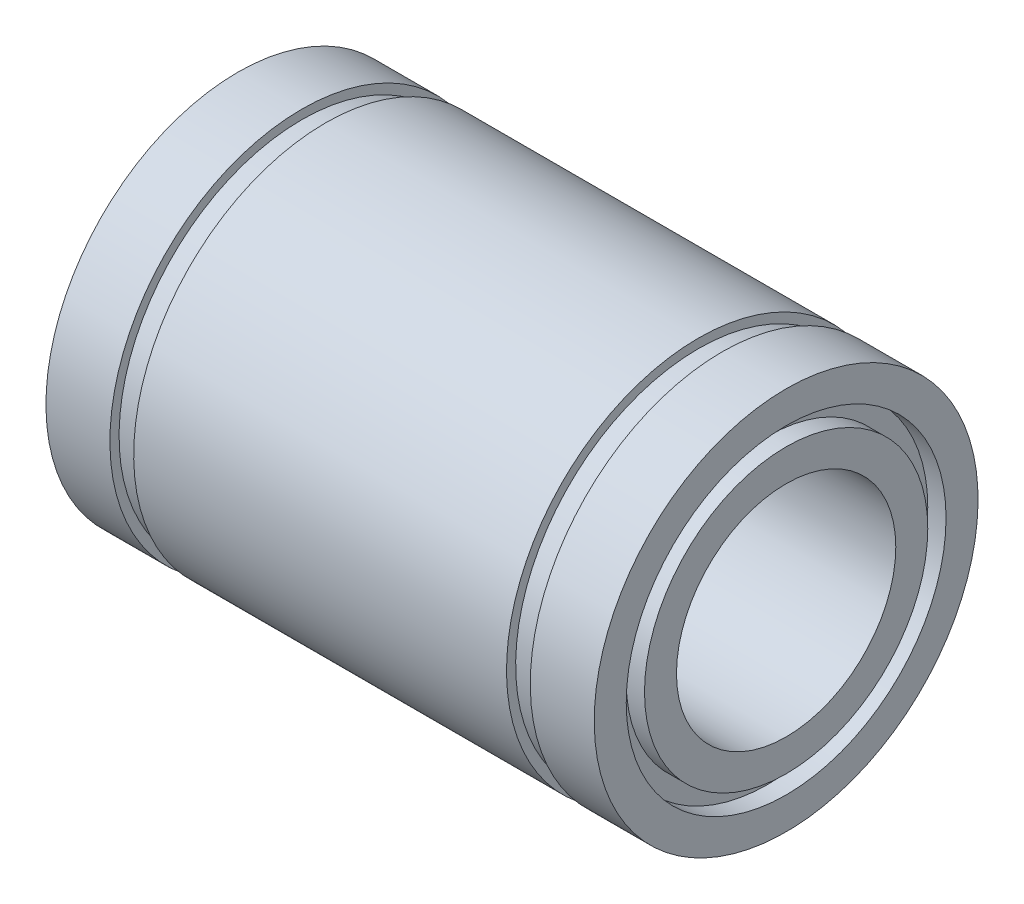
ISO-10303-21;
HEADER;
FILE_DESCRIPTION(('STEP AP214'),'2;1');
FILE_NAME('part.step','',(''),(''),'','','');
FILE_SCHEMA(('AUTOMOTIVE_DESIGN { 1 0 10303 214 1 1 1 1 }'));
ENDSEC;
DATA;
#1=APPLICATION_CONTEXT('core data for automotive mechanical design processes');
#2=APPLICATION_PROTOCOL_DEFINITION('international standard','automotive_design',2000,#1);
#3=PRODUCT_CONTEXT('',#1,'mechanical');
#4=PRODUCT('Part','Part','',(#3));
#5=PRODUCT_RELATED_PRODUCT_CATEGORY('part','',(#4));
#6=PRODUCT_DEFINITION_FORMATION('','',#4);
#7=PRODUCT_DEFINITION_CONTEXT('part definition',#1,'design');
#8=PRODUCT_DEFINITION('design','',#6,#7);
#9=PRODUCT_DEFINITION_SHAPE('','',#8);
#10=(LENGTH_UNIT() NAMED_UNIT(*) SI_UNIT(.MILLI.,.METRE.));
#11=(NAMED_UNIT(*) PLANE_ANGLE_UNIT() SI_UNIT($,.RADIAN.));
#12=(NAMED_UNIT(*) SI_UNIT($,.STERADIAN.) SOLID_ANGLE_UNIT());
#13=UNCERTAINTY_MEASURE_WITH_UNIT(LENGTH_MEASURE(1.E-05),#10,'distance_accuracy_value','');
#14=(GEOMETRIC_REPRESENTATION_CONTEXT(3) GLOBAL_UNCERTAINTY_ASSIGNED_CONTEXT((#13)) GLOBAL_UNIT_ASSIGNED_CONTEXT((#10,
#11,#12)) REPRESENTATION_CONTEXT('',''));
#15=CARTESIAN_POINT('',(0.,0.,0.));
#16=DIRECTION('',(0.,0.,1.));
#17=DIRECTION('',(1.,0.,0.));
#18=AXIS2_PLACEMENT_3D('',#15,#16,#17);
#19=CARTESIAN_POINT('',(-15.,8.75,0.));
#20=DIRECTION('',(-1.,0.,0.));
#21=DIRECTION('',(0.,-1.,0.));
#22=AXIS2_PLACEMENT_3D('',#19,#20,#21);
#23=PLANE('',#22);
#24=CARTESIAN_POINT('',(-15.,0.,0.));
#25=DIRECTION('',(1.,0.,0.));
#26=DIRECTION('',(0.,1.,0.));
#27=AXIS2_PLACEMENT_3D('',#24,#25,#26);
#28=CIRCLE('',#27,8.75);
#29=CARTESIAN_POINT('',(-15.,8.75,0.));
#30=VERTEX_POINT('',#29);
#31=EDGE_CURVE('E121',#30,#30,#28,.T.);
#32=ORIENTED_EDGE('',*,*,#31,.T.);
#33=EDGE_LOOP('',(#32));
#34=FACE_BOUND('',#33,.T.);
#35=CARTESIAN_POINT('',(-15.,0.,0.));
#36=DIRECTION('',(1.,0.,0.));
#37=DIRECTION('',(0.,1.,0.));
#38=AXIS2_PLACEMENT_3D('',#35,#36,#37);
#39=CIRCLE('',#38,10.5);
#40=CARTESIAN_POINT('',(-15.,10.5,0.));
#41=VERTEX_POINT('',#40);
#42=EDGE_CURVE('E10',#41,#41,#39,.T.);
#43=ORIENTED_EDGE('',*,*,#42,.F.);
#44=EDGE_LOOP('',(#43));
#45=FACE_BOUND('',#44,.T.);
#46=ADVANCED_FACE('F38',(#34,#45),#23,.T.);
#47=CARTESIAN_POINT('',(0.,0.,0.));
#48=DIRECTION('',(1.,0.,0.));
#49=DIRECTION('',(0.,1.,0.));
#50=AXIS2_PLACEMENT_3D('',#47,#48,#49);
#51=CYLINDRICAL_SURFACE('',#50,10.5);
#52=ORIENTED_EDGE('',*,*,#42,.T.);
#53=EDGE_LOOP('',(#52));
#54=FACE_BOUND('',#53,.T.);
#55=CARTESIAN_POINT('',(-11.5,0.,0.));
#56=DIRECTION('',(1.,0.,0.));
#57=DIRECTION('',(0.,1.,0.));
#58=AXIS2_PLACEMENT_3D('',#55,#56,#57);
#59=CIRCLE('',#58,10.5);
#60=CARTESIAN_POINT('',(-11.5,10.5,0.));
#61=VERTEX_POINT('',#60);
#62=EDGE_CURVE('E45',#61,#61,#59,.T.);
#63=ORIENTED_EDGE('',*,*,#62,.F.);
#64=EDGE_LOOP('',(#63));
#65=FACE_BOUND('',#64,.T.);
#66=ADVANCED_FACE('F140',(#54,#65),#51,.T.);
#67=CARTESIAN_POINT('',(-11.5,10.5,0.));
#68=DIRECTION('',(1.,0.,0.));
#69=DIRECTION('',(0.,1.,0.));
#70=AXIS2_PLACEMENT_3D('',#67,#68,#69);
#71=PLANE('',#70);
#72=ORIENTED_EDGE('',*,*,#62,.T.);
#73=EDGE_LOOP('',(#72));
#74=FACE_BOUND('',#73,.T.);
#75=CARTESIAN_POINT('',(-11.5,0.,0.));
#76=DIRECTION('',(1.,0.,0.));
#77=DIRECTION('',(0.,1.,0.));
#78=AXIS2_PLACEMENT_3D('',#75,#76,#77);
#79=CIRCLE('',#78,10.);
#80=CARTESIAN_POINT('',(-11.5,10.,0.));
#81=VERTEX_POINT('',#80);
#82=EDGE_CURVE('E52',#81,#81,#79,.T.);
#83=ORIENTED_EDGE('',*,*,#82,.F.);
#84=EDGE_LOOP('',(#83));
#85=FACE_BOUND('',#84,.T.);
#86=ADVANCED_FACE('F144',(#74,#85),#71,.T.);
#87=CARTESIAN_POINT('',(0.,0.,0.));
#88=DIRECTION('',(1.,0.,0.));
#89=DIRECTION('',(0.,1.,0.));
#90=AXIS2_PLACEMENT_3D('',#87,#88,#89);
#91=CYLINDRICAL_SURFACE('',#90,10.);
#92=ORIENTED_EDGE('',*,*,#82,.T.);
#93=EDGE_LOOP('',(#92));
#94=FACE_BOUND('',#93,.T.);
#95=CARTESIAN_POINT('',(-10.2,0.,0.));
#96=DIRECTION('',(1.,0.,0.));
#97=DIRECTION('',(0.,1.,0.));
#98=AXIS2_PLACEMENT_3D('',#95,#96,#97);
#99=CIRCLE('',#98,10.);
#100=CARTESIAN_POINT('',(-10.2,10.,0.));
#101=VERTEX_POINT('',#100);
#102=EDGE_CURVE('E59',#101,#101,#99,.T.);
#103=ORIENTED_EDGE('',*,*,#102,.F.);
#104=EDGE_LOOP('',(#103));
#105=FACE_BOUND('',#104,.T.);
#106=ADVANCED_FACE('F148',(#94,#105),#91,.T.);
#107=CARTESIAN_POINT('',(-10.2,10.,0.));
#108=DIRECTION('',(-1.,0.,0.));
#109=DIRECTION('',(0.,-1.,0.));
#110=AXIS2_PLACEMENT_3D('',#107,#108,#109);
#111=PLANE('',#110);
#112=ORIENTED_EDGE('',*,*,#102,.T.);
#113=EDGE_LOOP('',(#112));
#114=FACE_BOUND('',#113,.T.);
#115=CARTESIAN_POINT('',(-10.2,0.,0.));
#116=DIRECTION('',(1.,0.,0.));
#117=DIRECTION('',(0.,1.,0.));
#118=AXIS2_PLACEMENT_3D('',#115,#116,#117);
#119=CIRCLE('',#118,10.5);
#120=CARTESIAN_POINT('',(-10.2,10.5,0.));
#121=VERTEX_POINT('',#120);
#122=EDGE_CURVE('E65',#121,#121,#119,.T.);
#123=ORIENTED_EDGE('',*,*,#122,.F.);
#124=EDGE_LOOP('',(#123));
#125=FACE_BOUND('',#124,.T.);
#126=ADVANCED_FACE('F154',(#114,#125),#111,.T.);
#127=CARTESIAN_POINT('',(0.,0.,0.));
#128=DIRECTION('',(1.,0.,0.));
#129=DIRECTION('',(0.,1.,0.));
#130=AXIS2_PLACEMENT_3D('',#127,#128,#129);
#131=CYLINDRICAL_SURFACE('',#130,10.5);
#132=ORIENTED_EDGE('',*,*,#122,.T.);
#133=EDGE_LOOP('',(#132));
#134=FACE_BOUND('',#133,.T.);
#135=CARTESIAN_POINT('',(10.2,0.,0.));
#136=DIRECTION('',(1.,0.,0.));
#137=DIRECTION('',(0.,1.,0.));
#138=AXIS2_PLACEMENT_3D('',#135,#136,#137);
#139=CIRCLE('',#138,10.5);
#140=CARTESIAN_POINT('',(10.2,10.5,0.));
#141=VERTEX_POINT('',#140);
#142=EDGE_CURVE('E69',#141,#141,#139,.T.);
#143=ORIENTED_EDGE('',*,*,#142,.F.);
#144=EDGE_LOOP('',(#143));
#145=FACE_BOUND('',#144,.T.);
#146=ADVANCED_FACE('F158',(#134,#145),#131,.T.);
#147=CARTESIAN_POINT('',(10.2,10.5,0.));
#148=DIRECTION('',(1.,0.,0.));
#149=DIRECTION('',(0.,1.,0.));
#150=AXIS2_PLACEMENT_3D('',#147,#148,#149);
#151=PLANE('',#150);
#152=ORIENTED_EDGE('',*,*,#142,.T.);
#153=EDGE_LOOP('',(#152));
#154=FACE_BOUND('',#153,.T.);
#155=CARTESIAN_POINT('',(10.2,0.,0.));
#156=DIRECTION('',(1.,0.,0.));
#157=DIRECTION('',(0.,1.,0.));
#158=AXIS2_PLACEMENT_3D('',#155,#156,#157);
#159=CIRCLE('',#158,10.);
#160=CARTESIAN_POINT('',(10.2,10.,0.));
#161=VERTEX_POINT('',#160);
#162=EDGE_CURVE('E73',#161,#161,#159,.T.);
#163=ORIENTED_EDGE('',*,*,#162,.F.);
#164=EDGE_LOOP('',(#163));
#165=FACE_BOUND('',#164,.T.);
#166=ADVANCED_FACE('F162',(#154,#165),#151,.T.);
#167=CARTESIAN_POINT('',(0.,0.,0.));
#168=DIRECTION('',(1.,0.,0.));
#169=DIRECTION('',(0.,1.,0.));
#170=AXIS2_PLACEMENT_3D('',#167,#168,#169);
#171=CYLINDRICAL_SURFACE('',#170,10.);
#172=ORIENTED_EDGE('',*,*,#162,.T.);
#173=EDGE_LOOP('',(#172));
#174=FACE_BOUND('',#173,.T.);
#175=CARTESIAN_POINT('',(11.5,0.,0.));
#176=DIRECTION('',(1.,0.,0.));
#177=DIRECTION('',(0.,1.,0.));
#178=AXIS2_PLACEMENT_3D('',#175,#176,#177);
#179=CIRCLE('',#178,10.);
#180=CARTESIAN_POINT('',(11.5,10.,0.));
#181=VERTEX_POINT('',#180);
#182=EDGE_CURVE('E76',#181,#181,#179,.T.);
#183=ORIENTED_EDGE('',*,*,#182,.F.);
#184=EDGE_LOOP('',(#183));
#185=FACE_BOUND('',#184,.T.);
#186=ADVANCED_FACE('F166',(#174,#185),#171,.T.);
#187=CARTESIAN_POINT('',(11.5,10.,0.));
#188=DIRECTION('',(-1.,0.,0.));
#189=DIRECTION('',(0.,-1.,0.));
#190=AXIS2_PLACEMENT_3D('',#187,#188,#189);
#191=PLANE('',#190);
#192=ORIENTED_EDGE('',*,*,#182,.T.);
#193=EDGE_LOOP('',(#192));
#194=FACE_BOUND('',#193,.T.);
#195=CARTESIAN_POINT('',(11.5,0.,0.));
#196=DIRECTION('',(1.,0.,0.));
#197=DIRECTION('',(0.,1.,0.));
#198=AXIS2_PLACEMENT_3D('',#195,#196,#197);
#199=CIRCLE('',#198,10.5);
#200=CARTESIAN_POINT('',(11.5,10.5,0.));
#201=VERTEX_POINT('',#200);
#202=EDGE_CURVE('E80',#201,#201,#199,.T.);
#203=ORIENTED_EDGE('',*,*,#202,.F.);
#204=EDGE_LOOP('',(#203));
#205=FACE_BOUND('',#204,.T.);
#206=ADVANCED_FACE('F170',(#194,#205),#191,.T.);
#207=CARTESIAN_POINT('',(0.,0.,0.));
#208=DIRECTION('',(1.,0.,0.));
#209=DIRECTION('',(0.,1.,0.));
#210=AXIS2_PLACEMENT_3D('',#207,#208,#209);
#211=CYLINDRICAL_SURFACE('',#210,10.5);
#212=ORIENTED_EDGE('',*,*,#202,.T.);
#213=EDGE_LOOP('',(#212));
#214=FACE_BOUND('',#213,.T.);
#215=CARTESIAN_POINT('',(15.,0.,0.));
#216=DIRECTION('',(1.,0.,0.));
#217=DIRECTION('',(0.,1.,0.));
#218=AXIS2_PLACEMENT_3D('',#215,#216,#217);
#219=CIRCLE('',#218,10.5);
#220=CARTESIAN_POINT('',(15.,10.5,0.));
#221=VERTEX_POINT('',#220);
#222=EDGE_CURVE('E84',#221,#221,#219,.T.);
#223=ORIENTED_EDGE('',*,*,#222,.F.);
#224=EDGE_LOOP('',(#223));
#225=FACE_BOUND('',#224,.T.);
#226=ADVANCED_FACE('F174',(#214,#225),#211,.T.);
#227=CARTESIAN_POINT('',(15.,10.5,0.));
#228=DIRECTION('',(1.,0.,0.));
#229=DIRECTION('',(0.,1.,0.));
#230=AXIS2_PLACEMENT_3D('',#227,#228,#229);
#231=PLANE('',#230);
#232=ORIENTED_EDGE('',*,*,#222,.T.);
#233=EDGE_LOOP('',(#232));
#234=FACE_BOUND('',#233,.T.);
#235=CARTESIAN_POINT('',(15.,0.,0.));
#236=DIRECTION('',(1.,0.,0.));
#237=DIRECTION('',(0.,1.,0.));
#238=AXIS2_PLACEMENT_3D('',#235,#236,#237);
#239=CIRCLE('',#238,8.74999999999999);
#240=CARTESIAN_POINT('',(15.,8.74999999999999,0.));
#241=VERTEX_POINT('',#240);
#242=EDGE_CURVE('E88',#241,#241,#239,.T.);
#243=ORIENTED_EDGE('',*,*,#242,.F.);
#244=EDGE_LOOP('',(#243));
#245=FACE_BOUND('',#244,.T.);
#246=ADVANCED_FACE('F178',(#234,#245),#231,.T.);
#247=CARTESIAN_POINT('',(0.,0.,0.));
#248=DIRECTION('',(1.,0.,0.));
#249=DIRECTION('',(0.,1.,0.));
#250=AXIS2_PLACEMENT_3D('',#247,#248,#249);
#251=CYLINDRICAL_SURFACE('',#250,8.74999999999999);
#252=ORIENTED_EDGE('',*,*,#242,.T.);
#253=EDGE_LOOP('',(#252));
#254=FACE_BOUND('',#253,.T.);
#255=CARTESIAN_POINT('',(14.,0.,0.));
#256=DIRECTION('',(1.,0.,0.));
#257=DIRECTION('',(0.,1.,0.));
#258=AXIS2_PLACEMENT_3D('',#255,#256,#257);
#259=CIRCLE('',#258,8.74999999999999);
#260=CARTESIAN_POINT('',(14.,8.74999999999999,0.));
#261=VERTEX_POINT('',#260);
#262=EDGE_CURVE('E92',#261,#261,#259,.T.);
#263=ORIENTED_EDGE('',*,*,#262,.F.);
#264=EDGE_LOOP('',(#263));
#265=FACE_BOUND('',#264,.T.);
#266=ADVANCED_FACE('F182',(#254,#265),#251,.F.);
#267=CARTESIAN_POINT('',(14.,8.74999999999999,0.));
#268=DIRECTION('',(1.,0.,0.));
#269=DIRECTION('',(0.,1.,0.));
#270=AXIS2_PLACEMENT_3D('',#267,#268,#269);
#271=PLANE('',#270);
#272=ORIENTED_EDGE('',*,*,#262,.T.);
#273=EDGE_LOOP('',(#272));
#274=FACE_BOUND('',#273,.T.);
#275=CARTESIAN_POINT('',(14.,0.,0.));
#276=DIRECTION('',(1.,0.,0.));
#277=DIRECTION('',(0.,1.,0.));
#278=AXIS2_PLACEMENT_3D('',#275,#276,#277);
#279=CIRCLE('',#278,7.74999999999999);
#280=CARTESIAN_POINT('',(14.,7.74999999999999,0.));
#281=VERTEX_POINT('',#280);
#282=EDGE_CURVE('E96',#281,#281,#279,.T.);
#283=ORIENTED_EDGE('',*,*,#282,.F.);
#284=EDGE_LOOP('',(#283));
#285=FACE_BOUND('',#284,.T.);
#286=ADVANCED_FACE('F186',(#274,#285),#271,.T.);
#287=CARTESIAN_POINT('',(0.,0.,0.));
#288=DIRECTION('',(1.,0.,0.));
#289=DIRECTION('',(0.,1.,0.));
#290=AXIS2_PLACEMENT_3D('',#287,#288,#289);
#291=CYLINDRICAL_SURFACE('',#290,7.74999999999999);
#292=ORIENTED_EDGE('',*,*,#282,.T.);
#293=EDGE_LOOP('',(#292));
#294=FACE_BOUND('',#293,.T.);
#295=CARTESIAN_POINT('',(15.,0.,0.));
#296=DIRECTION('',(1.,0.,0.));
#297=DIRECTION('',(0.,1.,0.));
#298=AXIS2_PLACEMENT_3D('',#295,#296,#297);
#299=CIRCLE('',#298,7.74999999999999);
#300=CARTESIAN_POINT('',(15.,7.74999999999999,0.));
#301=VERTEX_POINT('',#300);
#302=EDGE_CURVE('E100',#301,#301,#299,.T.);
#303=ORIENTED_EDGE('',*,*,#302,.F.);
#304=EDGE_LOOP('',(#303));
#305=FACE_BOUND('',#304,.T.);
#306=ADVANCED_FACE('F190',(#294,#305),#291,.T.);
#307=CARTESIAN_POINT('',(15.,7.74999999999999,0.));
#308=DIRECTION('',(1.,0.,0.));
#309=DIRECTION('',(0.,1.,0.));
#310=AXIS2_PLACEMENT_3D('',#307,#308,#309);
#311=PLANE('',#310);
#312=ORIENTED_EDGE('',*,*,#302,.T.);
#313=EDGE_LOOP('',(#312));
#314=FACE_BOUND('',#313,.T.);
#315=CARTESIAN_POINT('',(15.,0.,0.));
#316=DIRECTION('',(1.,0.,0.));
#317=DIRECTION('',(0.,1.,0.));
#318=AXIS2_PLACEMENT_3D('',#315,#316,#317);
#319=CIRCLE('',#318,6.);
#320=CARTESIAN_POINT('',(15.,6.,0.));
#321=VERTEX_POINT('',#320);
#322=EDGE_CURVE('E103',#321,#321,#319,.T.);
#323=ORIENTED_EDGE('',*,*,#322,.F.);
#324=EDGE_LOOP('',(#323));
#325=FACE_BOUND('',#324,.T.);
#326=ADVANCED_FACE('F194',(#314,#325),#311,.T.);
#327=CARTESIAN_POINT('',(0.,0.,0.));
#328=DIRECTION('',(1.,0.,0.));
#329=DIRECTION('',(0.,1.,0.));
#330=AXIS2_PLACEMENT_3D('',#327,#328,#329);
#331=CYLINDRICAL_SURFACE('',#330,6.);
#332=ORIENTED_EDGE('',*,*,#322,.T.);
#333=EDGE_LOOP('',(#332));
#334=FACE_BOUND('',#333,.T.);
#335=CARTESIAN_POINT('',(-15.,0.,0.));
#336=DIRECTION('',(1.,0.,0.));
#337=DIRECTION('',(0.,1.,0.));
#338=AXIS2_PLACEMENT_3D('',#335,#336,#337);
#339=CIRCLE('',#338,6.);
#340=CARTESIAN_POINT('',(-15.,6.,0.));
#341=VERTEX_POINT('',#340);
#342=EDGE_CURVE('E106',#341,#341,#339,.T.);
#343=ORIENTED_EDGE('',*,*,#342,.F.);
#344=EDGE_LOOP('',(#343));
#345=FACE_BOUND('',#344,.T.);
#346=ADVANCED_FACE('F198',(#334,#345),#331,.F.);
#347=CARTESIAN_POINT('',(-15.,6.,0.));
#348=DIRECTION('',(-1.,0.,0.));
#349=DIRECTION('',(0.,-1.,0.));
#350=AXIS2_PLACEMENT_3D('',#347,#348,#349);
#351=PLANE('',#350);
#352=ORIENTED_EDGE('',*,*,#342,.T.);
#353=EDGE_LOOP('',(#352));
#354=FACE_BOUND('',#353,.T.);
#355=CARTESIAN_POINT('',(-15.,0.,0.));
#356=DIRECTION('',(1.,0.,0.));
#357=DIRECTION('',(0.,1.,0.));
#358=AXIS2_PLACEMENT_3D('',#355,#356,#357);
#359=CIRCLE('',#358,7.75);
#360=CARTESIAN_POINT('',(-15.,7.75,0.));
#361=VERTEX_POINT('',#360);
#362=EDGE_CURVE('E110',#361,#361,#359,.T.);
#363=ORIENTED_EDGE('',*,*,#362,.F.);
#364=EDGE_LOOP('',(#363));
#365=FACE_BOUND('',#364,.T.);
#366=ADVANCED_FACE('F202',(#354,#365),#351,.T.);
#367=CARTESIAN_POINT('',(0.,0.,0.));
#368=DIRECTION('',(1.,0.,0.));
#369=DIRECTION('',(0.,1.,0.));
#370=AXIS2_PLACEMENT_3D('',#367,#368,#369);
#371=CYLINDRICAL_SURFACE('',#370,7.75);
#372=ORIENTED_EDGE('',*,*,#362,.T.);
#373=EDGE_LOOP('',(#372));
#374=FACE_BOUND('',#373,.T.);
#375=CARTESIAN_POINT('',(-14.,0.,0.));
#376=DIRECTION('',(1.,0.,0.));
#377=DIRECTION('',(0.,1.,0.));
#378=AXIS2_PLACEMENT_3D('',#375,#376,#377);
#379=CIRCLE('',#378,7.75);
#380=CARTESIAN_POINT('',(-14.,7.75,0.));
#381=VERTEX_POINT('',#380);
#382=EDGE_CURVE('E114',#381,#381,#379,.T.);
#383=ORIENTED_EDGE('',*,*,#382,.F.);
#384=EDGE_LOOP('',(#383));
#385=FACE_BOUND('',#384,.T.);
#386=ADVANCED_FACE('F136',(#374,#385),#371,.T.);
#387=CARTESIAN_POINT('',(-14.,8.75,0.));
#388=DIRECTION('',(-1.,0.,0.));
#389=DIRECTION('',(0.,-1.,0.));
#390=AXIS2_PLACEMENT_3D('',#387,#388,#389);
#391=PLANE('',#390);
#392=ORIENTED_EDGE('',*,*,#382,.T.);
#393=EDGE_LOOP('',(#392));
#394=FACE_BOUND('',#393,.T.);
#395=CARTESIAN_POINT('',(-14.,0.,0.));
#396=DIRECTION('',(1.,0.,0.));
#397=DIRECTION('',(0.,1.,0.));
#398=AXIS2_PLACEMENT_3D('',#395,#396,#397);
#399=CIRCLE('',#398,8.75);
#400=CARTESIAN_POINT('',(-14.,8.75,0.));
#401=VERTEX_POINT('',#400);
#402=EDGE_CURVE('E118',#401,#401,#399,.T.);
#403=ORIENTED_EDGE('',*,*,#402,.F.);
#404=EDGE_LOOP('',(#403));
#405=FACE_BOUND('',#404,.T.);
#406=ADVANCED_FACE('F130',(#394,#405),#391,.T.);
#407=CARTESIAN_POINT('',(0.,0.,0.));
#408=DIRECTION('',(1.,0.,0.));
#409=DIRECTION('',(0.,1.,0.));
#410=AXIS2_PLACEMENT_3D('',#407,#408,#409);
#411=CYLINDRICAL_SURFACE('',#410,8.75);
#412=ORIENTED_EDGE('',*,*,#402,.T.);
#413=EDGE_LOOP('',(#412));
#414=FACE_BOUND('',#413,.T.);
#415=ORIENTED_EDGE('',*,*,#31,.F.);
#416=EDGE_LOOP('',(#415));
#417=FACE_BOUND('',#416,.T.);
#418=ADVANCED_FACE('F128',(#414,#417),#411,.F.);
#419=CLOSED_SHELL('',(#46,#66,#86,#106,#126,#146,#166,#186,#206,#226,#246,#266,#286,#306,#326,
#346,#366,#386,#406,#418));
#420=MANIFOLD_SOLID_BREP('B2',#419);
#421=ADVANCED_BREP_SHAPE_REPRESENTATION('',(#18,#420),#14);
#422=SHAPE_DEFINITION_REPRESENTATION(#9,#421);
ENDSEC;
END-ISO-10303-21;
